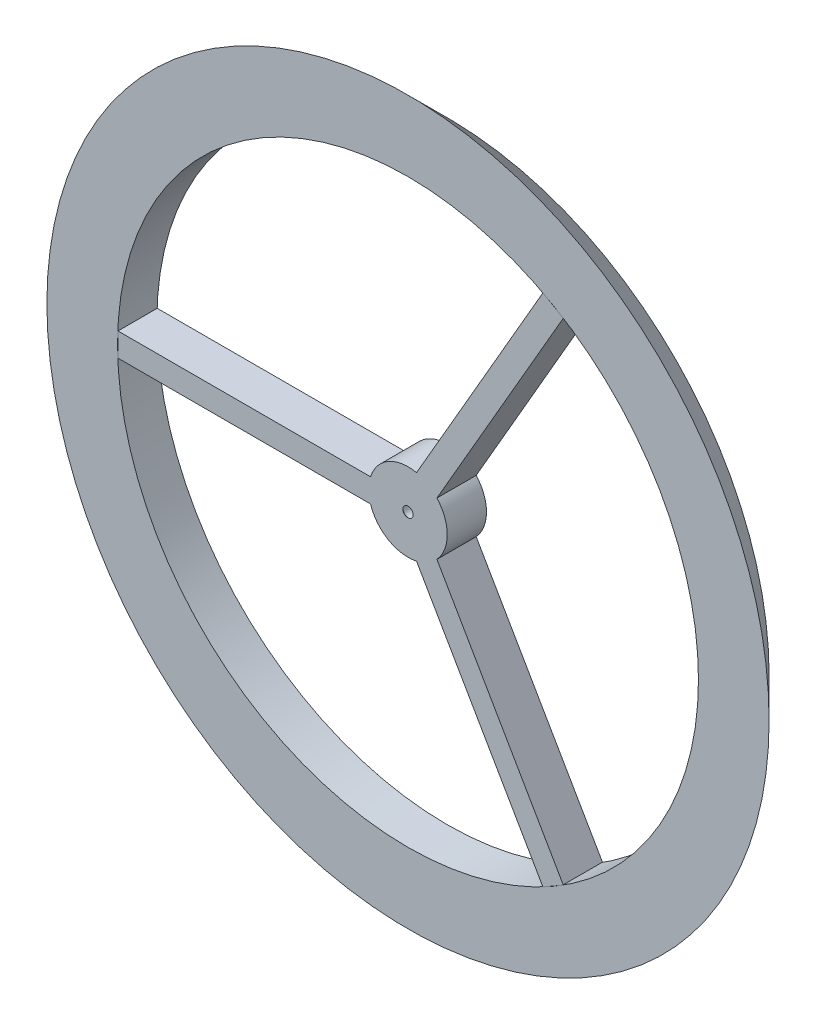
ISO-10303-21;
HEADER;
FILE_DESCRIPTION(('STEP AP214'),'2;1');
FILE_NAME('part.step','',(''),(''),'','','');
FILE_SCHEMA(('AUTOMOTIVE_DESIGN { 1 0 10303 214 1 1 1 1 }'));
ENDSEC;
DATA;
#1=APPLICATION_CONTEXT('core data for automotive mechanical design processes');
#2=APPLICATION_PROTOCOL_DEFINITION('international standard','automotive_design',2000,#1);
#3=PRODUCT_CONTEXT('',#1,'mechanical');
#4=PRODUCT('Part','Part','',(#3));
#5=PRODUCT_RELATED_PRODUCT_CATEGORY('part','',(#4));
#6=PRODUCT_DEFINITION_FORMATION('','',#4);
#7=PRODUCT_DEFINITION_CONTEXT('part definition',#1,'design');
#8=PRODUCT_DEFINITION('design','',#6,#7);
#9=PRODUCT_DEFINITION_SHAPE('','',#8);
#10=(LENGTH_UNIT() NAMED_UNIT(*) SI_UNIT(.MILLI.,.METRE.));
#11=(NAMED_UNIT(*) PLANE_ANGLE_UNIT() SI_UNIT($,.RADIAN.));
#12=(NAMED_UNIT(*) SI_UNIT($,.STERADIAN.) SOLID_ANGLE_UNIT());
#13=UNCERTAINTY_MEASURE_WITH_UNIT(LENGTH_MEASURE(1.E-05),#10,'distance_accuracy_value','');
#14=(GEOMETRIC_REPRESENTATION_CONTEXT(3) GLOBAL_UNCERTAINTY_ASSIGNED_CONTEXT((#13)) GLOBAL_UNIT_ASSIGNED_CONTEXT((#10,
#11,#12)) REPRESENTATION_CONTEXT('',''));
#15=CARTESIAN_POINT('',(0.,0.,0.));
#16=DIRECTION('',(0.,0.,1.));
#17=DIRECTION('',(1.,0.,0.));
#18=AXIS2_PLACEMENT_3D('',#15,#16,#17);
#19=CARTESIAN_POINT('',(0.,0.,19.142135623731));
#20=DIRECTION('',(0.,0.,-1.));
#21=DIRECTION('',(-1.,0.,0.));
#22=AXIS2_PLACEMENT_3D('',#19,#20,#21);
#23=CYLINDRICAL_SURFACE('',#22,5.);
#24=DIRECTION('',(0.,0.,-1.));
#25=VECTOR('',#24,1.);
#26=CARTESIAN_POINT('',(3.68388610921899,-3.38067791046461,19.142135623731));
#27=LINE('',#26,#25);
#28=CARTESIAN_POINT('',(3.68388610921899,-3.38067791046461,0.));
#29=VERTEX_POINT('',#28);
#30=CARTESIAN_POINT('',(3.68388610921899,-3.38067791046461,5.));
#31=VERTEX_POINT('',#30);
#32=EDGE_CURVE('E12',#29,#31,#27,.F.);
#33=ORIENTED_EDGE('',*,*,#32,.F.);
#34=CARTESIAN_POINT('',(0.,0.,0.));
#35=DIRECTION('',(0.,0.,-1.));
#36=DIRECTION('',(-1.,0.,0.));
#37=AXIS2_PLACEMENT_3D('',#34,#35,#36);
#38=CIRCLE('',#37,5.);
#39=CARTESIAN_POINT('',(3.68388610921902,3.38067791046452,0.));
#40=VERTEX_POINT('',#39);
#41=EDGE_CURVE('E195',#40,#29,#38,.T.);
#42=ORIENTED_EDGE('',*,*,#41,.F.);
#43=DIRECTION('',(0.,0.,-1.));
#44=VECTOR('',#43,1.);
#45=CARTESIAN_POINT('',(3.68388610921904,3.38067791046456,19.142135623731));
#46=LINE('',#45,#44);
#47=CARTESIAN_POINT('',(3.68388610921904,3.38067791046456,5.));
#48=VERTEX_POINT('',#47);
#49=EDGE_CURVE('E225',#48,#40,#46,.T.);
#50=ORIENTED_EDGE('',*,*,#49,.F.);
#51=CARTESIAN_POINT('',(0.,0.,5.));
#52=DIRECTION('',(0.,0.,1.));
#53=DIRECTION('',(1.,0.,0.));
#54=AXIS2_PLACEMENT_3D('',#51,#52,#53);
#55=CIRCLE('',#54,5.);
#56=EDGE_CURVE('E199',#48,#31,#55,.F.);
#57=ORIENTED_EDGE('',*,*,#56,.T.);
#58=EDGE_LOOP('',(#33,#42,#50,#57));
#59=FACE_BOUND('',#58,.T.);
#60=ADVANCED_FACE('F57',(#59),#23,.T.);
#61=DIRECTION('',(0.,0.,-1.));
#62=VECTOR('',#61,1.);
#63=CARTESIAN_POINT('',(1.08580989786573,4.88067791046457,19.142135623731));
#64=LINE('',#63,#62);
#65=CARTESIAN_POINT('',(1.08580989786573,4.88067791046457,0.));
#66=VERTEX_POINT('',#65);
#67=CARTESIAN_POINT('',(1.08580989786573,4.88067791046457,5.));
#68=VERTEX_POINT('',#67);
#69=EDGE_CURVE('E228',#66,#68,#64,.F.);
#70=ORIENTED_EDGE('',*,*,#69,.F.);
#71=CARTESIAN_POINT('',(-4.76969600708473,1.5,0.));
#72=VERTEX_POINT('',#71);
#73=EDGE_CURVE('E191',#72,#66,#38,.T.);
#74=ORIENTED_EDGE('',*,*,#73,.F.);
#75=DIRECTION('',(0.,0.,-1.));
#76=VECTOR('',#75,1.);
#77=CARTESIAN_POINT('',(-4.76969600708473,1.5,19.142135623731));
#78=LINE('',#77,#76);
#79=CARTESIAN_POINT('',(-4.76969600708473,1.5,5.));
#80=VERTEX_POINT('',#79);
#81=EDGE_CURVE('E215',#72,#80,#78,.F.);
#82=ORIENTED_EDGE('',*,*,#81,.T.);
#83=EDGE_CURVE('E196',#80,#68,#55,.F.);
#84=ORIENTED_EDGE('',*,*,#83,.T.);
#85=EDGE_LOOP('',(#70,#74,#82,#84));
#86=FACE_BOUND('',#85,.T.);
#87=ADVANCED_FACE('F259',(#86),#23,.T.);
#88=CARTESIAN_POINT('',(0.,0.,5.));
#89=DIRECTION('',(0.,0.,1.));
#90=DIRECTION('',(1.,0.,0.));
#91=AXIS2_PLACEMENT_3D('',#88,#89,#90);
#92=PLANE('',#91);
#93=CARTESIAN_POINT('',(0.,0.,5.));
#94=DIRECTION('',(0.,0.,1.));
#95=DIRECTION('',(1.,0.,0.));
#96=AXIS2_PLACEMENT_3D('',#93,#94,#95);
#97=CIRCLE('',#96,0.649999999999998);
#98=CARTESIAN_POINT('',(0.649999999999997,0.,5.));
#99=VERTEX_POINT('',#98);
#100=EDGE_CURVE('E250',#99,#99,#97,.T.);
#101=ORIENTED_EDGE('',*,*,#100,.F.);
#102=EDGE_LOOP('',(#101));
#103=FACE_BOUND('',#102,.T.);
#104=CARTESIAN_POINT('',(1.08580989786567,-4.88067791046459,5.));
#105=VERTEX_POINT('',#104);
#106=CARTESIAN_POINT('',(-4.76969600708473,-1.5,5.));
#107=VERTEX_POINT('',#106);
#108=EDGE_CURVE('E194',#105,#107,#55,.F.);
#109=ORIENTED_EDGE('',*,*,#108,.F.);
#110=DIRECTION('',(-0.499999999999992,0.866025403784443,0.));
#111=VECTOR('',#110,1.);
#112=CARTESIAN_POINT('',(43.8716725724413,-78.9879659084959,5.));
#113=LINE('',#112,#111);
#114=CARTESIAN_POINT('',(17.1857529399367,-32.7665972582973,5.));
#115=VERTEX_POINT('',#114);
#116=EDGE_CURVE('E158',#115,#105,#113,.T.);
#117=ORIENTED_EDGE('',*,*,#116,.F.);
#118=DIRECTION('',(-0.866025403784443,-0.499999999999992,0.));
#119=VECTOR('',#118,1.);
#120=CARTESIAN_POINT('',(18.4847910456134,-32.0165972582973,5.));
#121=LINE('',#120,#119);
#122=CARTESIAN_POINT('',(19.7838291512901,-31.2665972582973,5.));
#123=VERTEX_POINT('',#122);
#124=EDGE_CURVE('E156',#123,#115,#121,.T.);
#125=ORIENTED_EDGE('',*,*,#124,.F.);
#126=DIRECTION('',(0.499999999999992,-0.866025403784443,0.));
#127=VECTOR('',#126,1.);
#128=CARTESIAN_POINT('',(46.4697487837946,-77.487965908496,5.));
#129=LINE('',#128,#127);
#130=EDGE_CURVE('E144',#31,#123,#129,.T.);
#131=ORIENTED_EDGE('',*,*,#130,.F.);
#132=ORIENTED_EDGE('',*,*,#56,.F.);
#133=DIRECTION('',(-0.500000000000004,-0.866025403784436,0.));
#134=VECTOR('',#133,1.);
#135=CARTESIAN_POINT('',(46.4697487837957,77.4879659084953,5.));
#136=LINE('',#135,#134);
#137=CARTESIAN_POINT('',(19.7838291512905,31.266597258297,5.));
#138=VERTEX_POINT('',#137);
#139=EDGE_CURVE('E180',#138,#48,#136,.T.);
#140=ORIENTED_EDGE('',*,*,#139,.F.);
#141=DIRECTION('',(0.866025403784436,-0.500000000000004,0.));
#142=VECTOR('',#141,1.);
#143=CARTESIAN_POINT('',(18.4847910456139,32.0165972582971,5.));
#144=LINE('',#143,#142);
#145=CARTESIAN_POINT('',(17.1857529399372,32.7665972582971,5.));
#146=VERTEX_POINT('',#145);
#147=EDGE_CURVE('E185',#146,#138,#144,.T.);
#148=ORIENTED_EDGE('',*,*,#147,.F.);
#149=DIRECTION('',(0.500000000000004,0.866025403784436,0.));
#150=VECTOR('',#149,1.);
#151=CARTESIAN_POINT('',(43.8716725724424,78.9879659084953,5.));
#152=LINE('',#151,#150);
#153=EDGE_CURVE('E172',#68,#146,#152,.T.);
#154=ORIENTED_EDGE('',*,*,#153,.F.);
#155=ORIENTED_EDGE('',*,*,#83,.F.);
#156=DIRECTION('',(1.,0.,0.));
#157=VECTOR('',#156,1.);
#158=CARTESIAN_POINT('',(-90.3414213562373,1.50000000000001,5.));
#159=LINE('',#158,#157);
#160=CARTESIAN_POINT('',(-36.9695820912274,1.50000000000003,5.));
#161=VERTEX_POINT('',#160);
#162=EDGE_CURVE('E213',#161,#80,#159,.T.);
#163=ORIENTED_EDGE('',*,*,#162,.F.);
#164=DIRECTION('',(0.,1.,0.));
#165=VECTOR('',#164,1.);
#166=CARTESIAN_POINT('',(-36.9695820912274,0.,5.));
#167=LINE('',#166,#165);
#168=CARTESIAN_POINT('',(-36.9695820912274,-1.5,5.));
#169=VERTEX_POINT('',#168);
#170=EDGE_CURVE('E217',#169,#161,#167,.T.);
#171=ORIENTED_EDGE('',*,*,#170,.F.);
#172=DIRECTION('',(-1.,0.,0.));
#173=VECTOR('',#172,1.);
#174=CARTESIAN_POINT('',(-90.3414213562373,-1.5,5.));
#175=LINE('',#174,#173);
#176=EDGE_CURVE('E206',#107,#169,#175,.T.);
#177=ORIENTED_EDGE('',*,*,#176,.F.);
#178=EDGE_LOOP('',(#109,#117,#125,#131,#132,#140,#148,#154,#155,#163,#171,#177));
#179=FACE_BOUND('',#178,.T.);
#180=ADVANCED_FACE('F59',(#103,#179),#92,.T.);
#181=CARTESIAN_POINT('',(-90.3414213562373,0.,0.));
#182=DIRECTION('',(0.,0.,-1.));
#183=DIRECTION('',(-1.,0.,0.));
#184=AXIS2_PLACEMENT_3D('',#181,#182,#183);
#185=PLANE('',#184);
#186=CARTESIAN_POINT('',(0.,0.,0.));
#187=DIRECTION('',(0.,0.,-1.));
#188=DIRECTION('',(-1.,0.,0.));
#189=AXIS2_PLACEMENT_3D('',#186,#187,#188);
#190=CIRCLE('',#189,0.749999999999998);
#191=CARTESIAN_POINT('',(-0.749999999999991,0.,0.));
#192=VERTEX_POINT('',#191);
#193=EDGE_CURVE('E61',#192,#192,#190,.T.);
#194=ORIENTED_EDGE('',*,*,#193,.F.);
#195=EDGE_LOOP('',(#194));
#196=FACE_BOUND('',#195,.T.);
#197=ORIENTED_EDGE('',*,*,#41,.T.);
#198=DIRECTION('',(0.499999999999992,-0.866025403784443,0.));
#199=VECTOR('',#198,1.);
#200=CARTESIAN_POINT('',(46.4697487837946,-77.487965908496,0.));
#201=LINE('',#200,#199);
#202=CARTESIAN_POINT('',(19.7838291512901,-31.2665972582973,0.));
#203=VERTEX_POINT('',#202);
#204=EDGE_CURVE('E239',#29,#203,#201,.T.);
#205=ORIENTED_EDGE('',*,*,#204,.T.);
#206=DIRECTION('',(-0.866025403784443,-0.499999999999992,0.));
#207=VECTOR('',#206,1.);
#208=CARTESIAN_POINT('',(18.4847910456134,-32.0165972582973,0.));
#209=LINE('',#208,#207);
#210=CARTESIAN_POINT('',(17.1857529399367,-32.7665972582973,0.));
#211=VERTEX_POINT('',#210);
#212=EDGE_CURVE('E165',#203,#211,#209,.T.);
#213=ORIENTED_EDGE('',*,*,#212,.T.);
#214=DIRECTION('',(-0.499999999999992,0.866025403784443,0.));
#215=VECTOR('',#214,1.);
#216=CARTESIAN_POINT('',(43.8716725724413,-78.9879659084959,0.));
#217=LINE('',#216,#215);
#218=CARTESIAN_POINT('',(1.08580989786567,-4.88067791046459,0.));
#219=VERTEX_POINT('',#218);
#220=EDGE_CURVE('E153',#211,#219,#217,.T.);
#221=ORIENTED_EDGE('',*,*,#220,.T.);
#222=CARTESIAN_POINT('',(-4.76969600708473,-1.5,0.));
#223=VERTEX_POINT('',#222);
#224=EDGE_CURVE('E183',#219,#223,#38,.T.);
#225=ORIENTED_EDGE('',*,*,#224,.T.);
#226=DIRECTION('',(-1.,0.,0.));
#227=VECTOR('',#226,1.);
#228=CARTESIAN_POINT('',(-90.3414213562373,-1.5,0.));
#229=LINE('',#228,#227);
#230=CARTESIAN_POINT('',(-36.9695820912274,-1.5,0.));
#231=VERTEX_POINT('',#230);
#232=EDGE_CURVE('E202',#223,#231,#229,.T.);
#233=ORIENTED_EDGE('',*,*,#232,.T.);
#234=DIRECTION('',(0.,1.,0.));
#235=VECTOR('',#234,1.);
#236=CARTESIAN_POINT('',(-36.9695820912274,0.,0.));
#237=LINE('',#236,#235);
#238=CARTESIAN_POINT('',(-36.9695820912274,1.50000000000003,0.));
#239=VERTEX_POINT('',#238);
#240=EDGE_CURVE('E207',#231,#239,#237,.T.);
#241=ORIENTED_EDGE('',*,*,#240,.T.);
#242=DIRECTION('',(1.,0.,0.));
#243=VECTOR('',#242,1.);
#244=CARTESIAN_POINT('',(-90.3414213562373,1.50000000000001,0.));
#245=LINE('',#244,#243);
#246=EDGE_CURVE('E203',#239,#72,#245,.T.);
#247=ORIENTED_EDGE('',*,*,#246,.T.);
#248=ORIENTED_EDGE('',*,*,#73,.T.);
#249=DIRECTION('',(0.500000000000004,0.866025403784436,0.));
#250=VECTOR('',#249,1.);
#251=CARTESIAN_POINT('',(43.8716725724424,78.9879659084953,0.));
#252=LINE('',#251,#250);
#253=CARTESIAN_POINT('',(17.1857529399372,32.7665972582971,0.));
#254=VERTEX_POINT('',#253);
#255=EDGE_CURVE('E176',#66,#254,#252,.T.);
#256=ORIENTED_EDGE('',*,*,#255,.T.);
#257=DIRECTION('',(0.866025403784436,-0.500000000000004,0.));
#258=VECTOR('',#257,1.);
#259=CARTESIAN_POINT('',(18.4847910456139,32.0165972582971,0.));
#260=LINE('',#259,#258);
#261=CARTESIAN_POINT('',(19.7838291512905,31.266597258297,0.));
#262=VERTEX_POINT('',#261);
#263=EDGE_CURVE('E173',#254,#262,#260,.T.);
#264=ORIENTED_EDGE('',*,*,#263,.T.);
#265=DIRECTION('',(-0.500000000000004,-0.866025403784436,0.));
#266=VECTOR('',#265,1.);
#267=CARTESIAN_POINT('',(46.4697487837957,77.4879659084953,0.));
#268=LINE('',#267,#266);
#269=EDGE_CURVE('E169',#262,#40,#268,.T.);
#270=ORIENTED_EDGE('',*,*,#269,.T.);
#271=EDGE_LOOP('',(#197,#205,#213,#221,#225,#233,#241,#247,#248,#256,#264,#270));
#272=FACE_BOUND('',#271,.T.);
#273=ADVANCED_FACE('F236',(#196,#272),#185,.T.);
#274=CARTESIAN_POINT('',(-90.3414213562373,-1.5,42.0911040547461));
#275=DIRECTION('',(0.,-1.,0.));
#276=DIRECTION('',(0.,0.,-1.));
#277=AXIS2_PLACEMENT_3D('',#274,#275,#276);
#278=PLANE('',#277);
#279=DIRECTION('',(0.,0.,-1.));
#280=VECTOR('',#279,1.);
#281=CARTESIAN_POINT('',(-4.76969600708473,-1.5,19.142135623731));
#282=LINE('',#281,#280);
#283=EDGE_CURVE('E198',#107,#223,#282,.T.);
#284=ORIENTED_EDGE('',*,*,#283,.F.);
#285=ORIENTED_EDGE('',*,*,#176,.T.);
#286=DIRECTION('',(0.,0.,-1.));
#287=VECTOR('',#286,1.);
#288=CARTESIAN_POINT('',(-36.9695820912274,-1.5,42.0911040547461));
#289=LINE('',#288,#287);
#290=EDGE_CURVE('E212',#169,#231,#289,.T.);
#291=ORIENTED_EDGE('',*,*,#290,.T.);
#292=ORIENTED_EDGE('',*,*,#232,.F.);
#293=EDGE_LOOP('',(#284,#285,#291,#292));
#294=FACE_BOUND('',#293,.T.);
#295=ADVANCED_FACE('F264',(#294),#278,.T.);
#296=CARTESIAN_POINT('',(-36.9695820912274,0.,42.0911040547461));
#297=DIRECTION('',(-1.,0.,0.));
#298=DIRECTION('',(0.,0.,1.));
#299=AXIS2_PLACEMENT_3D('',#296,#297,#298);
#300=PLANE('',#299);
#301=ORIENTED_EDGE('',*,*,#290,.F.);
#302=ORIENTED_EDGE('',*,*,#170,.T.);
#303=DIRECTION('',(0.,0.,-1.));
#304=VECTOR('',#303,1.);
#305=CARTESIAN_POINT('',(-36.9695820912274,1.50000000000003,42.0911040547461));
#306=LINE('',#305,#304);
#307=EDGE_CURVE('E216',#161,#239,#306,.T.);
#308=ORIENTED_EDGE('',*,*,#307,.T.);
#309=ORIENTED_EDGE('',*,*,#240,.F.);
#310=EDGE_LOOP('',(#301,#302,#308,#309));
#311=FACE_BOUND('',#310,.T.);
#312=ADVANCED_FACE('F283',(#311),#300,.T.);
#313=CARTESIAN_POINT('',(-90.3414213562373,1.50000000000001,42.0911040547461));
#314=DIRECTION('',(0.,1.,0.));
#315=DIRECTION('',(-1.,0.,0.));
#316=AXIS2_PLACEMENT_3D('',#313,#314,#315);
#317=PLANE('',#316);
#318=ORIENTED_EDGE('',*,*,#81,.F.);
#319=ORIENTED_EDGE('',*,*,#246,.F.);
#320=ORIENTED_EDGE('',*,*,#307,.F.);
#321=ORIENTED_EDGE('',*,*,#162,.T.);
#322=EDGE_LOOP('',(#318,#319,#320,#321));
#323=FACE_BOUND('',#322,.T.);
#324=ADVANCED_FACE('F276',(#323),#317,.T.);
#325=DIRECTION('',(0.,0.,-1.));
#326=VECTOR('',#325,1.);
#327=CARTESIAN_POINT('',(1.08580989786567,-4.88067791046458,19.142135623731));
#328=LINE('',#327,#326);
#329=EDGE_CURVE('E66',#105,#219,#328,.T.);
#330=ORIENTED_EDGE('',*,*,#329,.F.);
#331=ORIENTED_EDGE('',*,*,#108,.T.);
#332=ORIENTED_EDGE('',*,*,#283,.T.);
#333=ORIENTED_EDGE('',*,*,#224,.F.);
#334=EDGE_LOOP('',(#330,#331,#332,#333));
#335=FACE_BOUND('',#334,.T.);
#336=ADVANCED_FACE('F269',(#335),#23,.T.);
#337=CARTESIAN_POINT('',(43.8716725724424,78.9879659084953,42.0911040547461));
#338=DIRECTION('',(-0.866025403784436,0.500000000000004,0.));
#339=DIRECTION('',(0.,0.,-1.));
#340=AXIS2_PLACEMENT_3D('',#337,#338,#339);
#341=PLANE('',#340);
#342=ORIENTED_EDGE('',*,*,#255,.F.);
#343=ORIENTED_EDGE('',*,*,#69,.T.);
#344=ORIENTED_EDGE('',*,*,#153,.T.);
#345=DIRECTION('',(0.,0.,-1.));
#346=VECTOR('',#345,1.);
#347=CARTESIAN_POINT('',(17.1857529399372,32.7665972582971,42.0911040547461));
#348=LINE('',#347,#346);
#349=EDGE_CURVE('E179',#146,#254,#348,.T.);
#350=ORIENTED_EDGE('',*,*,#349,.T.);
#351=EDGE_LOOP('',(#342,#343,#344,#350));
#352=FACE_BOUND('',#351,.T.);
#353=ADVANCED_FACE('F275',(#352),#341,.T.);
#354=CARTESIAN_POINT('',(18.4847910456139,32.0165972582971,42.0911040547461));
#355=DIRECTION('',(0.500000000000004,0.866025403784436,0.));
#356=DIRECTION('',(0.,0.,1.));
#357=AXIS2_PLACEMENT_3D('',#354,#355,#356);
#358=PLANE('',#357);
#359=ORIENTED_EDGE('',*,*,#349,.F.);
#360=ORIENTED_EDGE('',*,*,#147,.T.);
#361=DIRECTION('',(0.,0.,-1.));
#362=VECTOR('',#361,1.);
#363=CARTESIAN_POINT('',(19.7838291512905,31.266597258297,42.0911040547461));
#364=LINE('',#363,#362);
#365=EDGE_CURVE('E184',#138,#262,#364,.T.);
#366=ORIENTED_EDGE('',*,*,#365,.T.);
#367=ORIENTED_EDGE('',*,*,#263,.F.);
#368=EDGE_LOOP('',(#359,#360,#366,#367));
#369=FACE_BOUND('',#368,.T.);
#370=ADVANCED_FACE('F281',(#369),#358,.T.);
#371=CARTESIAN_POINT('',(46.4697487837957,77.4879659084953,42.0911040547461));
#372=DIRECTION('',(0.866025403784436,-0.500000000000004,0.));
#373=DIRECTION('',(0.500000000000004,0.866025403784436,0.));
#374=AXIS2_PLACEMENT_3D('',#371,#372,#373);
#375=PLANE('',#374);
#376=ORIENTED_EDGE('',*,*,#139,.T.);
#377=ORIENTED_EDGE('',*,*,#49,.T.);
#378=ORIENTED_EDGE('',*,*,#269,.F.);
#379=ORIENTED_EDGE('',*,*,#365,.F.);
#380=EDGE_LOOP('',(#376,#377,#378,#379));
#381=FACE_BOUND('',#380,.T.);
#382=ADVANCED_FACE('F313',(#381),#375,.T.);
#383=CARTESIAN_POINT('',(46.4697487837946,-77.487965908496,42.0911040547461));
#384=DIRECTION('',(0.866025403784443,0.499999999999992,0.));
#385=DIRECTION('',(0.,0.,-1.));
#386=AXIS2_PLACEMENT_3D('',#383,#384,#385);
#387=PLANE('',#386);
#388=ORIENTED_EDGE('',*,*,#204,.F.);
#389=ORIENTED_EDGE('',*,*,#32,.T.);
#390=ORIENTED_EDGE('',*,*,#130,.T.);
#391=DIRECTION('',(0.,0.,-1.));
#392=VECTOR('',#391,1.);
#393=CARTESIAN_POINT('',(19.7838291512901,-31.2665972582973,42.0911040547461));
#394=LINE('',#393,#392);
#395=EDGE_CURVE('E149',#123,#203,#394,.T.);
#396=ORIENTED_EDGE('',*,*,#395,.T.);
#397=EDGE_LOOP('',(#388,#389,#390,#396));
#398=FACE_BOUND('',#397,.T.);
#399=ADVANCED_FACE('F147',(#398),#387,.T.);
#400=CARTESIAN_POINT('',(18.4847910456134,-32.0165972582973,42.0911040547461));
#401=DIRECTION('',(0.499999999999992,-0.866025403784443,0.));
#402=DIRECTION('',(0.,0.,1.));
#403=AXIS2_PLACEMENT_3D('',#400,#401,#402);
#404=PLANE('',#403);
#405=ORIENTED_EDGE('',*,*,#395,.F.);
#406=ORIENTED_EDGE('',*,*,#124,.T.);
#407=DIRECTION('',(0.,0.,-1.));
#408=VECTOR('',#407,1.);
#409=CARTESIAN_POINT('',(17.1857529399367,-32.7665972582973,42.0911040547461));
#410=LINE('',#409,#408);
#411=EDGE_CURVE('E161',#115,#211,#410,.T.);
#412=ORIENTED_EDGE('',*,*,#411,.T.);
#413=ORIENTED_EDGE('',*,*,#212,.F.);
#414=EDGE_LOOP('',(#405,#406,#412,#413));
#415=FACE_BOUND('',#414,.T.);
#416=ADVANCED_FACE('F163',(#415),#404,.T.);
#417=CARTESIAN_POINT('',(43.8716725724413,-78.9879659084959,42.0911040547461));
#418=DIRECTION('',(-0.866025403784443,-0.499999999999992,0.));
#419=DIRECTION('',(0.499999999999992,-0.866025403784443,0.));
#420=AXIS2_PLACEMENT_3D('',#417,#418,#419);
#421=PLANE('',#420);
#422=ORIENTED_EDGE('',*,*,#116,.T.);
#423=ORIENTED_EDGE('',*,*,#329,.T.);
#424=ORIENTED_EDGE('',*,*,#220,.F.);
#425=ORIENTED_EDGE('',*,*,#411,.F.);
#426=EDGE_LOOP('',(#422,#423,#424,#425));
#427=FACE_BOUND('',#426,.T.);
#428=ADVANCED_FACE('F234',(#427),#421,.T.);
#429=CARTESIAN_POINT('',(0.,0.,-11.4));
#430=DIRECTION('',(0.,0.,1.));
#431=DIRECTION('',(1.,0.,0.));
#432=AXIS2_PLACEMENT_3D('',#429,#430,#431);
#433=CYLINDRICAL_SURFACE('',#432,0.749999999999998);
#434=ORIENTED_EDGE('',*,*,#193,.T.);
#435=EDGE_LOOP('',(#434));
#436=FACE_BOUND('',#435,.T.);
#437=CARTESIAN_POINT('',(0.,0.,4.9));
#438=DIRECTION('',(0.,0.,1.));
#439=DIRECTION('',(1.,0.,0.));
#440=AXIS2_PLACEMENT_3D('',#437,#438,#439);
#441=CIRCLE('',#440,0.749999999999998);
#442=CARTESIAN_POINT('',(0.749999999999997,0.,4.9));
#443=VERTEX_POINT('',#442);
#444=EDGE_CURVE('E242',#443,#443,#441,.F.);
#445=ORIENTED_EDGE('',*,*,#444,.F.);
#446=EDGE_LOOP('',(#445));
#447=FACE_BOUND('',#446,.T.);
#448=ADVANCED_FACE('F327',(#436,#447),#433,.F.);
#449=CARTESIAN_POINT('',(0.,0.,5.));
#450=DIRECTION('',(0.,0.,-1.));
#451=DIRECTION('',(-1.,0.,0.));
#452=AXIS2_PLACEMENT_3D('',#449,#450,#451);
#453=CONICAL_SURFACE('',#452,0.649999999999998,0.785398163397452);
#454=ORIENTED_EDGE('',*,*,#444,.T.);
#455=EDGE_LOOP('',(#454));
#456=FACE_BOUND('',#455,.T.);
#457=ORIENTED_EDGE('',*,*,#100,.T.);
#458=EDGE_LOOP('',(#457));
#459=FACE_BOUND('',#458,.T.);
#460=ADVANCED_FACE('F256',(#456,#459),#453,.F.);
#461=CLOSED_SHELL('',(#60,#87,#180,#273,#295,#312,#324,#336,#353,#370,#382,#399,#416,#428,#448,#460));
#462=MANIFOLD_SOLID_BREP('B2',#461);
#463=CARTESIAN_POINT('',(0.,0.,0.));
#464=DIRECTION('',(0.,0.,1.));
#465=DIRECTION('',(1.,0.,0.));
#466=AXIS2_PLACEMENT_3D('',#463,#464,#465);
#467=PLANE('',#466);
#468=CARTESIAN_POINT('',(0.,0.,0.));
#469=DIRECTION('',(0.,0.,1.));
#470=DIRECTION('',(1.,0.,0.));
#471=AXIS2_PLACEMENT_3D('',#468,#469,#470);
#472=CIRCLE('',#471,37.);
#473=CARTESIAN_POINT('',(37.,0.,0.));
#474=VERTEX_POINT('',#473);
#475=EDGE_CURVE('E557',#474,#474,#472,.T.);
#476=ORIENTED_EDGE('',*,*,#475,.T.);
#477=EDGE_LOOP('',(#476));
#478=FACE_BOUND('',#477,.T.);
#479=CARTESIAN_POINT('',(0.,0.,0.));
#480=DIRECTION('',(0.,0.,1.));
#481=DIRECTION('',(1.,0.,0.));
#482=AXIS2_PLACEMENT_3D('',#479,#480,#481);
#483=CIRCLE('',#482,41.);
#484=CARTESIAN_POINT('',(41.,0.,0.));
#485=VERTEX_POINT('',#484);
#486=EDGE_CURVE('E568',#485,#485,#483,.T.);
#487=ORIENTED_EDGE('',*,*,#486,.F.);
#488=EDGE_LOOP('',(#487));
#489=FACE_BOUND('',#488,.T.);
#490=ADVANCED_FACE('F554',(#478,#489),#467,.F.);
#491=CARTESIAN_POINT('',(0.,0.,5.));
#492=DIRECTION('',(0.,0.,1.));
#493=DIRECTION('',(1.,0.,0.));
#494=AXIS2_PLACEMENT_3D('',#491,#492,#493);
#495=PLANE('',#494);
#496=CARTESIAN_POINT('',(0.,0.,5.));
#497=DIRECTION('',(0.,0.,1.));
#498=DIRECTION('',(1.,0.,0.));
#499=AXIS2_PLACEMENT_3D('',#496,#497,#498);
#500=CIRCLE('',#499,46.);
#501=CARTESIAN_POINT('',(46.,0.,5.));
#502=VERTEX_POINT('',#501);
#503=EDGE_CURVE('E564',#502,#502,#500,.T.);
#504=ORIENTED_EDGE('',*,*,#503,.T.);
#505=EDGE_LOOP('',(#504));
#506=FACE_BOUND('',#505,.T.);
#507=CARTESIAN_POINT('',(0.,0.,5.));
#508=DIRECTION('',(0.,0.,1.));
#509=DIRECTION('',(1.,0.,0.));
#510=AXIS2_PLACEMENT_3D('',#507,#508,#509);
#511=CIRCLE('',#510,37.);
#512=CARTESIAN_POINT('',(37.,0.,5.));
#513=VERTEX_POINT('',#512);
#514=EDGE_CURVE('E56',#513,#513,#511,.T.);
#515=ORIENTED_EDGE('',*,*,#514,.F.);
#516=EDGE_LOOP('',(#515));
#517=FACE_BOUND('',#516,.T.);
#518=ADVANCED_FACE('F577',(#506,#517),#495,.T.);
#519=CARTESIAN_POINT('',(0.,0.,5.));
#520=DIRECTION('',(0.,0.,-1.));
#521=DIRECTION('',(-1.,0.,0.));
#522=AXIS2_PLACEMENT_3D('',#519,#520,#521);
#523=CYLINDRICAL_SURFACE('',#522,37.);
#524=ORIENTED_EDGE('',*,*,#514,.T.);
#525=EDGE_LOOP('',(#524));
#526=FACE_BOUND('',#525,.T.);
#527=ORIENTED_EDGE('',*,*,#475,.F.);
#528=EDGE_LOOP('',(#527));
#529=FACE_BOUND('',#528,.T.);
#530=ADVANCED_FACE('F582',(#526,#529),#523,.F.);
#531=CARTESIAN_POINT('',(0.,0.,5.));
#532=DIRECTION('',(0.,0.,1.));
#533=DIRECTION('',(1.,0.,0.));
#534=AXIS2_PLACEMENT_3D('',#531,#532,#533);
#535=CONICAL_SURFACE('',#534,46.,0.785398163397449);
#536=ORIENTED_EDGE('',*,*,#486,.T.);
#537=EDGE_LOOP('',(#536));
#538=FACE_BOUND('',#537,.T.);
#539=ORIENTED_EDGE('',*,*,#503,.F.);
#540=EDGE_LOOP('',(#539));
#541=FACE_BOUND('',#540,.T.);
#542=ADVANCED_FACE('F573',(#538,#541),#535,.T.);
#543=CLOSED_SHELL('',(#490,#518,#530,#542));
#544=MANIFOLD_SOLID_BREP('B6',#543);
#545=ADVANCED_BREP_SHAPE_REPRESENTATION('',(#18,#462,#544),#14);
#546=SHAPE_DEFINITION_REPRESENTATION(#9,#545);
ENDSEC;
END-ISO-10303-21;
